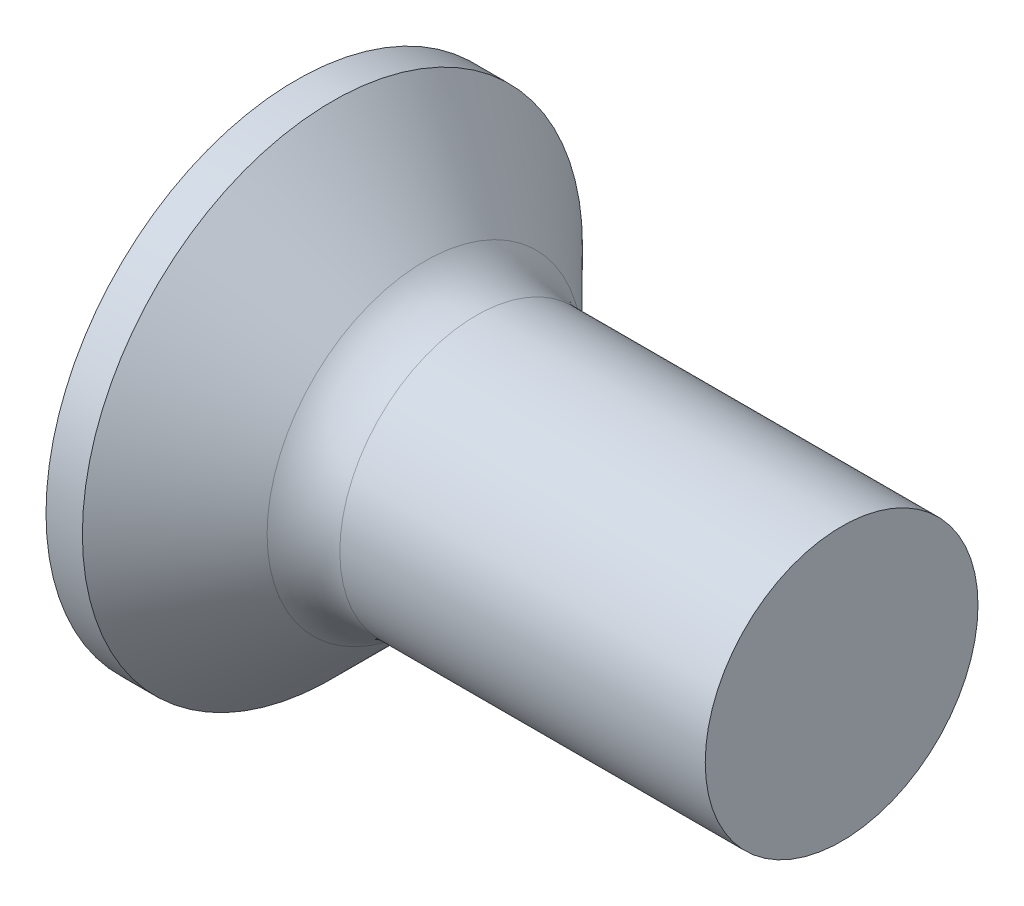
ISO-10303-21;
HEADER;
FILE_DESCRIPTION(('STEP AP214'),'2;1');
FILE_NAME('part.step','',(''),(''),'','','');
FILE_SCHEMA(('AUTOMOTIVE_DESIGN { 1 0 10303 214 1 1 1 1 }'));
ENDSEC;
DATA;
#1=APPLICATION_CONTEXT('core data for automotive mechanical design processes');
#2=APPLICATION_PROTOCOL_DEFINITION('international standard','automotive_design',2000,#1);
#3=PRODUCT_CONTEXT('',#1,'mechanical');
#4=PRODUCT('Part','Part','',(#3));
#5=PRODUCT_RELATED_PRODUCT_CATEGORY('part','',(#4));
#6=PRODUCT_DEFINITION_FORMATION('','',#4);
#7=PRODUCT_DEFINITION_CONTEXT('part definition',#1,'design');
#8=PRODUCT_DEFINITION('design','',#6,#7);
#9=PRODUCT_DEFINITION_SHAPE('','',#8);
#10=(LENGTH_UNIT() NAMED_UNIT(*) SI_UNIT(.MILLI.,.METRE.));
#11=(NAMED_UNIT(*) PLANE_ANGLE_UNIT() SI_UNIT($,.RADIAN.));
#12=(NAMED_UNIT(*) SI_UNIT($,.STERADIAN.) SOLID_ANGLE_UNIT());
#13=UNCERTAINTY_MEASURE_WITH_UNIT(LENGTH_MEASURE(1.E-05),#10,'distance_accuracy_value','');
#14=(GEOMETRIC_REPRESENTATION_CONTEXT(3) GLOBAL_UNCERTAINTY_ASSIGNED_CONTEXT((#13)) GLOBAL_UNIT_ASSIGNED_CONTEXT((#10,
#11,#12)) REPRESENTATION_CONTEXT('',''));
#15=CARTESIAN_POINT('',(0.,0.,0.));
#16=DIRECTION('',(0.,0.,1.));
#17=DIRECTION('',(1.,0.,0.));
#18=AXIS2_PLACEMENT_3D('',#15,#16,#17);
#19=CARTESIAN_POINT('',(0.,0.,0.));
#20=DIRECTION('',(-1.,0.,0.));
#21=DIRECTION('',(0.,0.,1.));
#22=AXIS2_PLACEMENT_3D('',#19,#20,#21);
#23=PLANE('',#22);
#24=CARTESIAN_POINT('',(0.,0.,0.));
#25=DIRECTION('',(-1.,0.,0.));
#26=DIRECTION('',(0.,0.,1.));
#27=AXIS2_PLACEMENT_3D('',#24,#25,#26);
#28=CIRCLE('',#27,2.75);
#29=CARTESIAN_POINT('',(0.,0.,2.75));
#30=VERTEX_POINT('',#29);
#31=EDGE_CURVE('E234',#30,#30,#28,.T.);
#32=ORIENTED_EDGE('',*,*,#31,.T.);
#33=EDGE_LOOP('',(#32));
#34=FACE_BOUND('',#33,.T.);
#35=DIRECTION('',(0.,0.,-1.));
#36=VECTOR('',#35,1.);
#37=CARTESIAN_POINT('',(0.,-0.370000000000005,1.5));
#38=LINE('',#37,#36);
#39=CARTESIAN_POINT('',(0.,-0.370000000000005,1.5));
#40=VERTEX_POINT('',#39);
#41=CARTESIAN_POINT('',(0.,-0.370000000000002,0.590157547916261));
#42=VERTEX_POINT('',#41);
#43=EDGE_CURVE('E324',#40,#42,#38,.T.);
#44=ORIENTED_EDGE('',*,*,#43,.T.);
#45=CARTESIAN_POINT('',(0.,0.,0.));
#46=DIRECTION('',(-1.,0.,0.));
#47=DIRECTION('',(0.,0.,1.));
#48=AXIS2_PLACEMENT_3D('',#45,#46,#47);
#49=CIRCLE('',#48,0.69655289200644);
#50=CARTESIAN_POINT('',(0.,-0.590157547916262,0.37));
#51=VERTEX_POINT('',#50);
#52=EDGE_CURVE('E429',#51,#42,#49,.T.);
#53=ORIENTED_EDGE('',*,*,#52,.F.);
#54=DIRECTION('',(0.,-1.,0.));
#55=VECTOR('',#54,1.);
#56=CARTESIAN_POINT('',(0.,1.5,0.37));
#57=LINE('',#56,#55);
#58=CARTESIAN_POINT('',(0.,-1.5,0.37));
#59=VERTEX_POINT('',#58);
#60=EDGE_CURVE('E285',#51,#59,#57,.T.);
#61=ORIENTED_EDGE('',*,*,#60,.T.);
#62=DIRECTION('',(0.,0.,-1.));
#63=VECTOR('',#62,1.);
#64=CARTESIAN_POINT('',(0.,-1.5,0.37));
#65=LINE('',#64,#63);
#66=CARTESIAN_POINT('',(0.,-1.5,-0.369999999999999));
#67=VERTEX_POINT('',#66);
#68=EDGE_CURVE('E247',#59,#67,#65,.T.);
#69=ORIENTED_EDGE('',*,*,#68,.T.);
#70=DIRECTION('',(0.,1.,0.));
#71=VECTOR('',#70,1.);
#72=CARTESIAN_POINT('',(0.,-1.5,-0.369999999999999));
#73=LINE('',#72,#71);
#74=CARTESIAN_POINT('',(0.,-0.590157547916262,-0.37));
#75=VERTEX_POINT('',#74);
#76=EDGE_CURVE('E279',#67,#75,#73,.T.);
#77=ORIENTED_EDGE('',*,*,#76,.T.);
#78=CARTESIAN_POINT('',(0.,-0.369999999999998,-0.590157547916264));
#79=VERTEX_POINT('',#78);
#80=EDGE_CURVE('E438',#79,#75,#49,.T.);
#81=ORIENTED_EDGE('',*,*,#80,.F.);
#82=CARTESIAN_POINT('',(0.,-0.369999999999995,-1.5));
#83=VERTEX_POINT('',#82);
#84=EDGE_CURVE('E327',#79,#83,#38,.T.);
#85=ORIENTED_EDGE('',*,*,#84,.T.);
#86=DIRECTION('',(0.,1.,0.));
#87=VECTOR('',#86,1.);
#88=CARTESIAN_POINT('',(0.,-0.369999999999995,-1.5));
#89=LINE('',#88,#87);
#90=CARTESIAN_POINT('',(0.,0.370000000000004,-1.5));
#91=VERTEX_POINT('',#90);
#92=EDGE_CURVE('E321',#83,#91,#89,.T.);
#93=ORIENTED_EDGE('',*,*,#92,.T.);
#94=DIRECTION('',(0.,0.,1.));
#95=VECTOR('',#94,1.);
#96=CARTESIAN_POINT('',(0.,0.370000000000004,-1.5));
#97=LINE('',#96,#95);
#98=CARTESIAN_POINT('',(0.,0.370000000000002,-0.590157547916261));
#99=VERTEX_POINT('',#98);
#100=EDGE_CURVE('E317',#91,#99,#97,.T.);
#101=ORIENTED_EDGE('',*,*,#100,.T.);
#102=CARTESIAN_POINT('',(0.,0.590157547916263,-0.369999999999999));
#103=VERTEX_POINT('',#102);
#104=EDGE_CURVE('E433',#103,#99,#49,.T.);
#105=ORIENTED_EDGE('',*,*,#104,.F.);
#106=CARTESIAN_POINT('',(0.,1.5,-0.369999999999999));
#107=VERTEX_POINT('',#106);
#108=EDGE_CURVE('E278',#103,#107,#73,.T.);
#109=ORIENTED_EDGE('',*,*,#108,.T.);
#110=DIRECTION('',(0.,0.,1.));
#111=VECTOR('',#110,1.);
#112=CARTESIAN_POINT('',(0.,1.5,-0.369999999999999));
#113=LINE('',#112,#111);
#114=CARTESIAN_POINT('',(0.,1.5,0.37));
#115=VERTEX_POINT('',#114);
#116=EDGE_CURVE('E281',#107,#115,#113,.T.);
#117=ORIENTED_EDGE('',*,*,#116,.T.);
#118=CARTESIAN_POINT('',(0.,0.590157547916263,0.37));
#119=VERTEX_POINT('',#118);
#120=EDGE_CURVE('E249',#115,#119,#57,.T.);
#121=ORIENTED_EDGE('',*,*,#120,.T.);
#122=CARTESIAN_POINT('',(0.,0.369999999999997,0.590157547916264));
#123=VERTEX_POINT('',#122);
#124=EDGE_CURVE('E432',#123,#119,#49,.T.);
#125=ORIENTED_EDGE('',*,*,#124,.F.);
#126=CARTESIAN_POINT('',(0.,0.369999999999994,1.5));
#127=VERTEX_POINT('',#126);
#128=EDGE_CURVE('E316',#123,#127,#97,.T.);
#129=ORIENTED_EDGE('',*,*,#128,.T.);
#130=DIRECTION('',(0.,-1.,0.));
#131=VECTOR('',#130,1.);
#132=CARTESIAN_POINT('',(0.,0.369999999999994,1.5));
#133=LINE('',#132,#131);
#134=EDGE_CURVE('E320',#127,#40,#133,.T.);
#135=ORIENTED_EDGE('',*,*,#134,.T.);
#136=EDGE_LOOP('',(#44,#53,#61,#69,#77,#81,#85,#93,#101,#105,#109,#117,#121,#125,#129,#135));
#137=FACE_BOUND('',#136,.T.);
#138=ADVANCED_FACE('F34',(#34,#137),#23,.T.);
#139=CARTESIAN_POINT('',(2.01,-0.497851002391851,0.370000000000001));
#140=DIRECTION('',(0.,0.,-1.));
#141=DIRECTION('',(-1.,0.,0.));
#142=AXIS2_PLACEMENT_3D('',#139,#140,#141);
#143=PLANE('',#142);
#144=ORIENTED_EDGE('',*,*,#60,.F.);
#145=CARTESIAN_POINT('',(-1.01053649699026,-0.672102030078459,0.37));
#146=CARTESIAN_POINT('',(-0.799706058781646,-0.65526709888962,0.37));
#147=CARTESIAN_POINT('',(-0.588886212565098,-0.638297110577309,0.37));
#148=CARTESIAN_POINT('',(-0.167272662573758,-0.603984130523452,0.37));
#149=CARTESIAN_POINT('',(0.0435210405937219,-0.586641131327184,0.37));
#150=CARTESIAN_POINT('',(0.465068838236452,-0.551479911668093,0.37));
#151=CARTESIAN_POINT('',(0.675822932725247,-0.533661691368077,0.37));
#152=CARTESIAN_POINT('',(1.09727362087867,-0.497387538868942,0.37));
#153=CARTESIAN_POINT('',(1.30797021528206,-0.478931615293403,0.37));
#154=CARTESIAN_POINT('',(1.67418894765493,-0.446067164114375,0.37));
#155=CARTESIAN_POINT('',(1.82972932594024,-0.431862501020784,0.37));
#156=CARTESIAN_POINT('',(2.14074770367772,-0.402797709732014,0.370000000000001));
#157=CARTESIAN_POINT('',(2.29622570364502,-0.387937587067169,0.370000000000001));
#158=CARTESIAN_POINT('',(2.60710169356699,-0.357305117929345,0.370000000000001));
#159=CARTESIAN_POINT('',(2.76249967848536,-0.341532719782114,0.370000000000001));
#160=CARTESIAN_POINT('',(2.99549070750468,-0.316847908272696,0.370000000000001));
#161=CARTESIAN_POINT('',(3.07313791127142,-0.308448465888146,0.370000000000001));
#162=CARTESIAN_POINT('',(3.22838341584044,-0.291202251038987,0.370000000000001));
#163=CARTESIAN_POINT('',(3.30598171607669,-0.282355473489552,0.370000000000001));
#164=CARTESIAN_POINT('',(3.38354828471668,-0.273232461280213,0.370000000000001));
#165=B_SPLINE_CURVE_WITH_KNOTS('',3,(#145,#146,#147,#148,#149,#150,#151,#152,#153,#154,#155,
#156,#157,#158,#159,#160,#161,#162,#163,#164),.UNSPECIFIED.,.F.,.F.,(4,2,2,2,2,2,2,2,2,4),(0.,
0.634504777580944,1.26902224771403,1.90353950046914,2.53804817608336,3.00661008454961,
3.47516804035678,3.94375256285268,4.17805198347564,4.41235406796206),.UNSPECIFIED.);
#166=CARTESIAN_POINT('',(2.01,-0.415013252800436,0.370000000000001));
#167=VERTEX_POINT('',#166);
#168=EDGE_CURVE('E330',#51,#167,#165,.T.);
#169=ORIENTED_EDGE('',*,*,#168,.T.);
#170=DIRECTION('',(0.,-1.,0.));
#171=VECTOR('',#170,1.);
#172=CARTESIAN_POINT('',(2.01,0.497851002391851,0.37));
#173=LINE('',#172,#171);
#174=CARTESIAN_POINT('',(2.01,-0.497851002391851,0.370000000000001));
#175=VERTEX_POINT('',#174);
#176=EDGE_CURVE('E265',#167,#175,#173,.T.);
#177=ORIENTED_EDGE('',*,*,#176,.T.);
#178=DIRECTION('',(0.894934367749961,0.446197800778958,0.));
#179=VECTOR('',#178,1.);
#180=CARTESIAN_POINT('',(0.,-1.5,0.37));
#181=LINE('',#180,#179);
#182=EDGE_CURVE('E275',#59,#175,#181,.T.);
#183=ORIENTED_EDGE('',*,*,#182,.F.);
#184=EDGE_LOOP('',(#144,#169,#177,#183));
#185=FACE_BOUND('',#184,.T.);
#186=ADVANCED_FACE('F188',(#185),#143,.T.);
#187=CARTESIAN_POINT('',(2.01,0.497851002391851,0.37));
#188=VERTEX_POINT('',#187);
#189=CARTESIAN_POINT('',(2.01,0.415013252800436,0.37));
#190=VERTEX_POINT('',#189);
#191=EDGE_CURVE('E262',#188,#190,#173,.T.);
#192=ORIENTED_EDGE('',*,*,#191,.T.);
#193=CARTESIAN_POINT('',(-1.01053649691082,0.672102030072117,0.369999999999999));
#194=CARTESIAN_POINT('',(-0.799706058711029,0.655267098883947,0.369999999999999));
#195=CARTESIAN_POINT('',(-0.588886212503304,0.638297110572311,0.369999999999999));
#196=CARTESIAN_POINT('',(-0.16727266252961,0.603984130519827,0.37));
#197=CARTESIAN_POINT('',(0.0435210406290474,0.586641131324258,0.37));
#198=CARTESIAN_POINT('',(0.465068838244709,0.551479911667384,0.37));
#199=CARTESIAN_POINT('',(0.67582293271526,0.533661691368909,0.37));
#200=CARTESIAN_POINT('',(1.09727362083221,0.49738753887297,0.37));
#201=CARTESIAN_POINT('',(1.30797021521736,0.478931615299088,0.37));
#202=CARTESIAN_POINT('',(1.67418894757201,0.446067164121905,0.37));
#203=CARTESIAN_POINT('',(1.82972932585734,0.431862501028413,0.37));
#204=CARTESIAN_POINT('',(2.14074770359484,0.402797709739879,0.37));
#205=CARTESIAN_POINT('',(2.29622570356215,0.387937587075169,0.37));
#206=CARTESIAN_POINT('',(2.60710169348415,0.357305117937675,0.370000000000001));
#207=CARTESIAN_POINT('',(2.76249967840253,0.341532719790639,0.370000000000001));
#208=CARTESIAN_POINT('',(2.99549070742189,0.316847908281593,0.370000000000001));
#209=CARTESIAN_POINT('',(3.07313791118864,0.308448465897181,0.370000000000001));
#210=CARTESIAN_POINT('',(3.22838341575769,0.291202251048337,0.370000000000001));
#211=CARTESIAN_POINT('',(3.30598171599396,0.28235547349908,0.370000000000001));
#212=CARTESIAN_POINT('',(3.38354828463398,0.273232461289949,0.370000000000001));
#213=B_SPLINE_CURVE_WITH_KNOTS('',3,(#193,#194,#195,#196,#197,#198,#199,#200,#201,#202,#203,
#204,#205,#206,#207,#208,#209,#210,#211,#212),.UNSPECIFIED.,.F.,.F.,(4,2,2,2,2,2,2,2,2,4),(0.,
0.634504777554396,1.26902224766093,1.90353950036111,2.53804817592041,3.00661008438666,
3.47516804019383,3.94375256268972,4.17805198331267,4.41235406779909),.UNSPECIFIED.);
#214=EDGE_CURVE('E336',#190,#119,#213,.F.);
#215=ORIENTED_EDGE('',*,*,#214,.T.);
#216=ORIENTED_EDGE('',*,*,#120,.F.);
#217=DIRECTION('',(0.89493436774996,-0.446197800778958,0.));
#218=VECTOR('',#217,1.);
#219=CARTESIAN_POINT('',(0.,1.5,0.37));
#220=LINE('',#219,#218);
#221=EDGE_CURVE('E57',#115,#188,#220,.T.);
#222=ORIENTED_EDGE('',*,*,#221,.T.);
#223=EDGE_LOOP('',(#192,#215,#216,#222));
#224=FACE_BOUND('',#223,.T.);
#225=ADVANCED_FACE('F194',(#224),#143,.T.);
#226=CARTESIAN_POINT('',(2.01,0.497851002391851,-0.37));
#227=DIRECTION('',(0.,0.,1.));
#228=DIRECTION('',(0.,-1.,0.));
#229=AXIS2_PLACEMENT_3D('',#226,#227,#228);
#230=PLANE('',#229);
#231=DIRECTION('',(0.,1.,0.));
#232=VECTOR('',#231,1.);
#233=CARTESIAN_POINT('',(2.01,-0.497851002391851,-0.37));
#234=LINE('',#233,#232);
#235=CARTESIAN_POINT('',(2.01,-0.497851002391851,-0.37));
#236=VERTEX_POINT('',#235);
#237=CARTESIAN_POINT('',(2.01,-0.415013252800436,-0.37));
#238=VERTEX_POINT('',#237);
#239=EDGE_CURVE('E252',#236,#238,#234,.T.);
#240=ORIENTED_EDGE('',*,*,#239,.T.);
#241=CARTESIAN_POINT('',(-1.01053649691082,-0.672102030072117,-0.369999999999999));
#242=CARTESIAN_POINT('',(-0.799706058711029,-0.655267098883947,-0.37));
#243=CARTESIAN_POINT('',(-0.588886212503303,-0.638297110572311,-0.37));
#244=CARTESIAN_POINT('',(-0.16727266252961,-0.603984130519827,-0.37));
#245=CARTESIAN_POINT('',(0.0435210406290474,-0.586641131324258,-0.37));
#246=CARTESIAN_POINT('',(0.465068838244709,-0.551479911667384,-0.37));
#247=CARTESIAN_POINT('',(0.67582293271526,-0.533661691368909,-0.37));
#248=CARTESIAN_POINT('',(1.09727362083221,-0.49738753887297,-0.37));
#249=CARTESIAN_POINT('',(1.30797021521736,-0.478931615299089,-0.37));
#250=CARTESIAN_POINT('',(1.67418894757201,-0.446067164121905,-0.37));
#251=CARTESIAN_POINT('',(1.82972932585734,-0.431862501028414,-0.37));
#252=CARTESIAN_POINT('',(2.14074770359484,-0.402797709739879,-0.37));
#253=CARTESIAN_POINT('',(2.29622570356215,-0.387937587075169,-0.37));
#254=CARTESIAN_POINT('',(2.60710169348415,-0.357305117937676,-0.37));
#255=CARTESIAN_POINT('',(2.76249967840253,-0.341532719790639,-0.37));
#256=CARTESIAN_POINT('',(2.99549070742189,-0.316847908281594,-0.37));
#257=CARTESIAN_POINT('',(3.07313791118864,-0.308448465897181,-0.37));
#258=CARTESIAN_POINT('',(3.22838341575769,-0.291202251048338,-0.37));
#259=CARTESIAN_POINT('',(3.30598171599396,-0.282355473499081,-0.37));
#260=CARTESIAN_POINT('',(3.38354828463398,-0.273232461289949,-0.37));
#261=B_SPLINE_CURVE_WITH_KNOTS('',3,(#241,#242,#243,#244,#245,#246,#247,#248,#249,#250,#251,
#252,#253,#254,#255,#256,#257,#258,#259,#260),.UNSPECIFIED.,.F.,.F.,(4,2,2,2,2,2,2,2,2,4),(0.,
0.634504777554396,1.26902224766093,1.90353950036111,2.53804817592041,3.00661008438666,
3.47516804019383,3.94375256268972,4.17805198331267,4.41235406779909),.UNSPECIFIED.);
#262=EDGE_CURVE('E385',#238,#75,#261,.F.);
#263=ORIENTED_EDGE('',*,*,#262,.T.);
#264=ORIENTED_EDGE('',*,*,#76,.F.);
#265=DIRECTION('',(0.89493436774996,0.446197800778958,0.));
#266=VECTOR('',#265,1.);
#267=CARTESIAN_POINT('',(0.,-1.5,-0.369999999999999));
#268=LINE('',#267,#266);
#269=EDGE_CURVE('E272',#67,#236,#268,.T.);
#270=ORIENTED_EDGE('',*,*,#269,.T.);
#271=EDGE_LOOP('',(#240,#263,#264,#270));
#272=FACE_BOUND('',#271,.T.);
#273=ADVANCED_FACE('F390',(#272),#230,.T.);
#274=ORIENTED_EDGE('',*,*,#108,.F.);
#275=CARTESIAN_POINT('',(-1.01053649699026,0.672102030078459,-0.369999999999999));
#276=CARTESIAN_POINT('',(-0.799706058781647,0.65526709888962,-0.369999999999999));
#277=CARTESIAN_POINT('',(-0.588886212565098,0.638297110577309,-0.369999999999999));
#278=CARTESIAN_POINT('',(-0.167272662573758,0.603984130523452,-0.369999999999999));
#279=CARTESIAN_POINT('',(0.0435210405937223,0.586641131327184,-0.369999999999999));
#280=CARTESIAN_POINT('',(0.465068838236453,0.551479911668094,-0.37));
#281=CARTESIAN_POINT('',(0.675822932725247,0.533661691368078,-0.37));
#282=CARTESIAN_POINT('',(1.09727362087867,0.497387538868942,-0.37));
#283=CARTESIAN_POINT('',(1.30797021528206,0.478931615293403,-0.37));
#284=CARTESIAN_POINT('',(1.67418894765493,0.446067164114375,-0.37));
#285=CARTESIAN_POINT('',(1.82972932594024,0.431862501020785,-0.37));
#286=CARTESIAN_POINT('',(2.14074770367772,0.402797709732015,-0.37));
#287=CARTESIAN_POINT('',(2.29622570364502,0.387937587067169,-0.37));
#288=CARTESIAN_POINT('',(2.60710169356699,0.357305117929345,-0.37));
#289=CARTESIAN_POINT('',(2.76249967848536,0.341532719782115,-0.37));
#290=CARTESIAN_POINT('',(2.99549070750468,0.316847908272697,-0.37));
#291=CARTESIAN_POINT('',(3.07313791127142,0.308448465888147,-0.37));
#292=CARTESIAN_POINT('',(3.22838341584044,0.291202251038988,-0.37));
#293=CARTESIAN_POINT('',(3.30598171607669,0.282355473489552,-0.37));
#294=CARTESIAN_POINT('',(3.38354828471668,0.273232461280214,-0.37));
#295=B_SPLINE_CURVE_WITH_KNOTS('',3,(#275,#276,#277,#278,#279,#280,#281,#282,#283,#284,#285,
#286,#287,#288,#289,#290,#291,#292,#293,#294),.UNSPECIFIED.,.F.,.F.,(4,2,2,2,2,2,2,2,2,4),(0.,
0.634504777580944,1.26902224771403,1.90353950046914,2.53804817608336,3.00661008454961,
3.47516804035678,3.94375256285268,4.17805198347564,4.41235406796206),.UNSPECIFIED.);
#296=CARTESIAN_POINT('',(2.01,0.415013252800436,-0.37));
#297=VERTEX_POINT('',#296);
#298=EDGE_CURVE('E380',#103,#297,#295,.T.);
#299=ORIENTED_EDGE('',*,*,#298,.T.);
#300=CARTESIAN_POINT('',(2.01,0.497851002391851,-0.37));
#301=VERTEX_POINT('',#300);
#302=EDGE_CURVE('E256',#297,#301,#234,.T.);
#303=ORIENTED_EDGE('',*,*,#302,.T.);
#304=DIRECTION('',(0.89493436774996,-0.446197800778958,0.));
#305=VECTOR('',#304,1.);
#306=CARTESIAN_POINT('',(0.,1.5,-0.369999999999999));
#307=LINE('',#306,#305);
#308=EDGE_CURVE('E260',#107,#301,#307,.T.);
#309=ORIENTED_EDGE('',*,*,#308,.F.);
#310=EDGE_LOOP('',(#274,#299,#303,#309));
#311=FACE_BOUND('',#310,.T.);
#312=ADVANCED_FACE('F393',(#311),#230,.T.);
#313=CARTESIAN_POINT('',(2.01,-0.497851002391851,-0.37));
#314=DIRECTION('',(-1.,0.,0.));
#315=DIRECTION('',(0.,0.,1.));
#316=AXIS2_PLACEMENT_3D('',#313,#314,#315);
#317=PLANE('',#316);
#318=DIRECTION('',(0.,-1.,0.));
#319=VECTOR('',#318,1.);
#320=CARTESIAN_POINT('',(2.01,0.369999999999998,0.497851002391852));
#321=LINE('',#320,#319);
#322=CARTESIAN_POINT('',(2.01,-0.247548741498374,0.49785100239185));
#323=VERTEX_POINT('',#322);
#324=CARTESIAN_POINT('',(2.01,-0.370000000000002,0.49785100239185));
#325=VERTEX_POINT('',#324);
#326=EDGE_CURVE('E291',#323,#325,#321,.T.);
#327=ORIENTED_EDGE('',*,*,#326,.F.);
#328=CARTESIAN_POINT('',(2.01,0.,0.));
#329=DIRECTION('',(-1.,0.,0.));
#330=DIRECTION('',(0.,0.,1.));
#331=AXIS2_PLACEMENT_3D('',#328,#329,#330);
#332=CIRCLE('',#331,0.555999999999999);
#333=CARTESIAN_POINT('',(2.01,-0.370000000000002,0.415013252800434));
#334=VERTEX_POINT('',#333);
#335=EDGE_CURVE('E49',#334,#323,#332,.T.);
#336=ORIENTED_EDGE('',*,*,#335,.F.);
#337=DIRECTION('',(0.,0.,-1.));
#338=VECTOR('',#337,1.);
#339=CARTESIAN_POINT('',(2.01,-0.370000000000002,0.497851002391849));
#340=LINE('',#339,#338);
#341=EDGE_CURVE('E298',#325,#334,#340,.T.);
#342=ORIENTED_EDGE('',*,*,#341,.F.);
#343=EDGE_LOOP('',(#327,#336,#342));
#344=FACE_BOUND('',#343,.T.);
#345=ADVANCED_FACE('F201',(#344),#317,.T.);
#346=ORIENTED_EDGE('',*,*,#176,.F.);
#347=CARTESIAN_POINT('',(2.01,-0.49785100239185,0.247548741498373));
#348=VERTEX_POINT('',#347);
#349=EDGE_CURVE('E459',#348,#167,#332,.T.);
#350=ORIENTED_EDGE('',*,*,#349,.F.);
#351=DIRECTION('',(0.,0.,-1.));
#352=VECTOR('',#351,1.);
#353=CARTESIAN_POINT('',(2.01,-0.497851002391851,0.370000000000001));
#354=LINE('',#353,#352);
#355=EDGE_CURVE('E257',#175,#348,#354,.T.);
#356=ORIENTED_EDGE('',*,*,#355,.F.);
#357=EDGE_LOOP('',(#346,#350,#356));
#358=FACE_BOUND('',#357,.T.);
#359=ADVANCED_FACE('F457',(#358),#317,.T.);
#360=CARTESIAN_POINT('',(2.01,-0.49785100239185,-0.247548741498373));
#361=VERTEX_POINT('',#360);
#362=EDGE_CURVE('E261',#361,#236,#354,.T.);
#363=ORIENTED_EDGE('',*,*,#362,.F.);
#364=EDGE_CURVE('E469',#238,#361,#332,.T.);
#365=ORIENTED_EDGE('',*,*,#364,.F.);
#366=ORIENTED_EDGE('',*,*,#239,.F.);
#367=EDGE_LOOP('',(#363,#365,#366));
#368=FACE_BOUND('',#367,.T.);
#369=ADVANCED_FACE('F467',(#368),#317,.T.);
#370=CARTESIAN_POINT('',(2.01,-0.369999999999999,-0.415013252800437));
#371=VERTEX_POINT('',#370);
#372=CARTESIAN_POINT('',(2.01,-0.369999999999999,-0.497851002391852));
#373=VERTEX_POINT('',#372);
#374=EDGE_CURVE('E301',#371,#373,#340,.T.);
#375=ORIENTED_EDGE('',*,*,#374,.F.);
#376=CARTESIAN_POINT('',(2.01,-0.247548741498372,-0.497851002391851));
#377=VERTEX_POINT('',#376);
#378=EDGE_CURVE('E472',#377,#371,#332,.T.);
#379=ORIENTED_EDGE('',*,*,#378,.F.);
#380=DIRECTION('',(0.,1.,0.));
#381=VECTOR('',#380,1.);
#382=CARTESIAN_POINT('',(2.01,-0.369999999999999,-0.497851002391852));
#383=LINE('',#382,#381);
#384=EDGE_CURVE('E293',#373,#377,#383,.T.);
#385=ORIENTED_EDGE('',*,*,#384,.F.);
#386=EDGE_LOOP('',(#375,#379,#385));
#387=FACE_BOUND('',#386,.T.);
#388=ADVANCED_FACE('F501',(#387),#317,.T.);
#389=CARTESIAN_POINT('',(2.01,0.247548741498374,-0.49785100239185));
#390=VERTEX_POINT('',#389);
#391=CARTESIAN_POINT('',(2.01,0.370000000000002,-0.497851002391849));
#392=VERTEX_POINT('',#391);
#393=EDGE_CURVE('E297',#390,#392,#383,.T.);
#394=ORIENTED_EDGE('',*,*,#393,.F.);
#395=CARTESIAN_POINT('',(2.01,0.370000000000002,-0.415013252800435));
#396=VERTEX_POINT('',#395);
#397=EDGE_CURVE('E427',#396,#390,#332,.T.);
#398=ORIENTED_EDGE('',*,*,#397,.F.);
#399=DIRECTION('',(0.,0.,1.));
#400=VECTOR('',#399,1.);
#401=CARTESIAN_POINT('',(2.01,0.370000000000002,-0.497851002391849));
#402=LINE('',#401,#400);
#403=EDGE_CURVE('E288',#392,#396,#402,.T.);
#404=ORIENTED_EDGE('',*,*,#403,.F.);
#405=EDGE_LOOP('',(#394,#398,#404));
#406=FACE_BOUND('',#405,.T.);
#407=ADVANCED_FACE('F497',(#406),#317,.T.);
#408=ORIENTED_EDGE('',*,*,#302,.F.);
#409=CARTESIAN_POINT('',(2.01,0.497851002391851,-0.247548741498373));
#410=VERTEX_POINT('',#409);
#411=EDGE_CURVE('E419',#410,#297,#332,.T.);
#412=ORIENTED_EDGE('',*,*,#411,.F.);
#413=DIRECTION('',(0.,0.,1.));
#414=VECTOR('',#413,1.);
#415=CARTESIAN_POINT('',(2.01,0.497851002391851,-0.37));
#416=LINE('',#415,#414);
#417=EDGE_CURVE('E266',#301,#410,#416,.T.);
#418=ORIENTED_EDGE('',*,*,#417,.F.);
#419=EDGE_LOOP('',(#408,#412,#418));
#420=FACE_BOUND('',#419,.T.);
#421=ADVANCED_FACE('F417',(#420),#317,.T.);
#422=CARTESIAN_POINT('',(2.01,0.497851002391851,0.247548741498373));
#423=VERTEX_POINT('',#422);
#424=EDGE_CURVE('E255',#423,#188,#416,.T.);
#425=ORIENTED_EDGE('',*,*,#424,.F.);
#426=EDGE_CURVE('E426',#190,#423,#332,.T.);
#427=ORIENTED_EDGE('',*,*,#426,.F.);
#428=ORIENTED_EDGE('',*,*,#191,.F.);
#429=EDGE_LOOP('',(#425,#427,#428));
#430=FACE_BOUND('',#429,.T.);
#431=ADVANCED_FACE('F491',(#430),#317,.T.);
#432=CARTESIAN_POINT('',(2.01,0.369999999999999,0.415013252800437));
#433=VERTEX_POINT('',#432);
#434=CARTESIAN_POINT('',(2.01,0.369999999999998,0.497851002391852));
#435=VERTEX_POINT('',#434);
#436=EDGE_CURVE('E292',#433,#435,#402,.T.);
#437=ORIENTED_EDGE('',*,*,#436,.F.);
#438=CARTESIAN_POINT('',(2.01,0.247548741498371,0.497851002391852));
#439=VERTEX_POINT('',#438);
#440=EDGE_CURVE('E428',#439,#433,#332,.T.);
#441=ORIENTED_EDGE('',*,*,#440,.F.);
#442=EDGE_CURVE('E302',#435,#439,#321,.T.);
#443=ORIENTED_EDGE('',*,*,#442,.F.);
#444=EDGE_LOOP('',(#437,#441,#443));
#445=FACE_BOUND('',#444,.T.);
#446=ADVANCED_FACE('F407',(#445),#317,.T.);
#447=CARTESIAN_POINT('',(0.,-1.5,-0.369999999999999));
#448=DIRECTION('',(-0.446197800778958,0.89493436774996,0.));
#449=DIRECTION('',(-0.89493436774996,-0.446197800778958,0.));
#450=AXIS2_PLACEMENT_3D('',#447,#448,#449);
#451=PLANE('',#450);
#452=ORIENTED_EDGE('',*,*,#355,.T.);
#453=CARTESIAN_POINT('',(2.86902882959523,-0.0695550419463993,0.));
#454=DIRECTION('',(-0.446197800778958,0.89493436774996,0.));
#455=DIRECTION('',(-0.89493436774996,-0.446197800778958,0.));
#456=AXIS2_PLACEMENT_3D('',#453,#454,#455);
#457=ELLIPSE('',#456,1.11145965245249,0.491029028347017);
#458=EDGE_CURVE('E461',#348,#361,#457,.F.);
#459=ORIENTED_EDGE('',*,*,#458,.T.);
#460=ORIENTED_EDGE('',*,*,#362,.T.);
#461=ORIENTED_EDGE('',*,*,#269,.F.);
#462=ORIENTED_EDGE('',*,*,#68,.F.);
#463=ORIENTED_EDGE('',*,*,#182,.T.);
#464=EDGE_LOOP('',(#452,#459,#460,#461,#462,#463));
#465=FACE_BOUND('',#464,.T.);
#466=ADVANCED_FACE('F399',(#465),#451,.T.);
#467=CARTESIAN_POINT('',(2.01,0.497851002391851,0.37));
#468=DIRECTION('',(-0.446197800778958,-0.89493436774996,0.));
#469=DIRECTION('',(0.89493436774996,-0.446197800778958,0.));
#470=AXIS2_PLACEMENT_3D('',#467,#468,#469);
#471=PLANE('',#470);
#472=ORIENTED_EDGE('',*,*,#417,.T.);
#473=CARTESIAN_POINT('',(2.86902882959523,0.0695550419463989,0.));
#474=DIRECTION('',(-0.446197800778958,-0.89493436774996,0.));
#475=DIRECTION('',(-0.89493436774996,0.446197800778958,0.));
#476=AXIS2_PLACEMENT_3D('',#473,#474,#475);
#477=ELLIPSE('',#476,1.11145965245249,0.491029028347017);
#478=EDGE_CURVE('E411',#410,#423,#477,.F.);
#479=ORIENTED_EDGE('',*,*,#478,.T.);
#480=ORIENTED_EDGE('',*,*,#424,.T.);
#481=ORIENTED_EDGE('',*,*,#221,.F.);
#482=ORIENTED_EDGE('',*,*,#116,.F.);
#483=ORIENTED_EDGE('',*,*,#308,.T.);
#484=EDGE_LOOP('',(#472,#479,#480,#481,#482,#483));
#485=FACE_BOUND('',#484,.T.);
#486=ADVANCED_FACE('F395',(#485),#471,.T.);
#487=CARTESIAN_POINT('',(2.01,-0.369999999999999,-0.497851002391852));
#488=DIRECTION('',(0.,1.,0.));
#489=DIRECTION('',(-1.,0.,0.));
#490=AXIS2_PLACEMENT_3D('',#487,#488,#489);
#491=PLANE('',#490);
#492=ORIENTED_EDGE('',*,*,#84,.F.);
#493=CARTESIAN_POINT('',(-1.01053649691082,-0.369999999999997,-0.672102030072118));
#494=CARTESIAN_POINT('',(-0.799706058711029,-0.369999999999997,-0.655267098883948));
#495=CARTESIAN_POINT('',(-0.588886212503303,-0.369999999999997,-0.638297110572312));
#496=CARTESIAN_POINT('',(-0.16727266252961,-0.369999999999998,-0.603984130519829));
#497=CARTESIAN_POINT('',(0.0435210406290476,-0.369999999999998,-0.586641131324259));
#498=CARTESIAN_POINT('',(0.465068838244709,-0.369999999999998,-0.551479911667386));
#499=CARTESIAN_POINT('',(0.67582293271526,-0.369999999999998,-0.53366169136891));
#500=CARTESIAN_POINT('',(1.09727362083221,-0.369999999999998,-0.497387538872971));
#501=CARTESIAN_POINT('',(1.30797021521736,-0.369999999999999,-0.47893161529909));
#502=CARTESIAN_POINT('',(1.67418894757201,-0.369999999999999,-0.446067164121906));
#503=CARTESIAN_POINT('',(1.82972932585734,-0.369999999999999,-0.431862501028414));
#504=CARTESIAN_POINT('',(2.14074770359484,-0.369999999999999,-0.40279770973988));
#505=CARTESIAN_POINT('',(2.29622570356215,-0.369999999999999,-0.38793758707517));
#506=CARTESIAN_POINT('',(2.60710169348415,-0.369999999999999,-0.357305117937676));
#507=CARTESIAN_POINT('',(2.76249967840253,-0.37,-0.34153271979064));
#508=CARTESIAN_POINT('',(2.99549070742189,-0.37,-0.316847908281594));
#509=CARTESIAN_POINT('',(3.07313791118864,-0.37,-0.308448465897182));
#510=CARTESIAN_POINT('',(3.22838341575769,-0.37,-0.291202251048339));
#511=CARTESIAN_POINT('',(3.30598171599396,-0.37,-0.282355473499082));
#512=CARTESIAN_POINT('',(3.38354828463398,-0.37,-0.27323246128995));
#513=B_SPLINE_CURVE_WITH_KNOTS('',3,(#493,#494,#495,#496,#497,#498,#499,#500,#501,#502,#503,
#504,#505,#506,#507,#508,#509,#510,#511,#512),.UNSPECIFIED.,.F.,.F.,(4,2,2,2,2,2,2,2,2,4),(0.,
0.634504777554396,1.26902224766093,1.90353950036111,2.53804817592041,3.00661008438666,
3.47516804019383,3.94375256268972,4.17805198331267,4.41235406779909),.UNSPECIFIED.);
#514=EDGE_CURVE('E373',#79,#371,#513,.T.);
#515=ORIENTED_EDGE('',*,*,#514,.T.);
#516=ORIENTED_EDGE('',*,*,#374,.T.);
#517=DIRECTION('',(0.894934367749961,0.,0.446197800778958));
#518=VECTOR('',#517,1.);
#519=CARTESIAN_POINT('',(0.,-0.369999999999995,-1.5));
#520=LINE('',#519,#518);
#521=EDGE_CURVE('E313',#83,#373,#520,.T.);
#522=ORIENTED_EDGE('',*,*,#521,.F.);
#523=EDGE_LOOP('',(#492,#515,#516,#522));
#524=FACE_BOUND('',#523,.T.);
#525=ADVANCED_FACE('F398',(#524),#491,.T.);
#526=CARTESIAN_POINT('',(2.01,0.369999999999998,0.497851002391852));
#527=DIRECTION('',(0.,-1.,0.));
#528=DIRECTION('',(0.,0.,-1.));
#529=AXIS2_PLACEMENT_3D('',#526,#527,#528);
#530=PLANE('',#529);
#531=ORIENTED_EDGE('',*,*,#403,.T.);
#532=CARTESIAN_POINT('',(-1.01053649691082,0.370000000000002,-0.672102030072116));
#533=CARTESIAN_POINT('',(-0.799706058711029,0.370000000000002,-0.655267098883946));
#534=CARTESIAN_POINT('',(-0.588886212503304,0.370000000000002,-0.638297110572309));
#535=CARTESIAN_POINT('',(-0.16727266252961,0.370000000000002,-0.603984130519826));
#536=CARTESIAN_POINT('',(0.0435210406290474,0.370000000000002,-0.586641131324257));
#537=CARTESIAN_POINT('',(0.465068838244709,0.370000000000002,-0.551479911667383));
#538=CARTESIAN_POINT('',(0.67582293271526,0.370000000000002,-0.533661691368907));
#539=CARTESIAN_POINT('',(1.09727362083221,0.370000000000002,-0.497387538872969));
#540=CARTESIAN_POINT('',(1.30797021521736,0.370000000000002,-0.478931615299087));
#541=CARTESIAN_POINT('',(1.67418894757201,0.370000000000002,-0.446067164121903));
#542=CARTESIAN_POINT('',(1.82972932585734,0.370000000000002,-0.431862501028412));
#543=CARTESIAN_POINT('',(2.14074770359484,0.370000000000001,-0.402797709739878));
#544=CARTESIAN_POINT('',(2.29622570356215,0.370000000000001,-0.387937587075168));
#545=CARTESIAN_POINT('',(2.60710169348415,0.370000000000001,-0.357305117937674));
#546=CARTESIAN_POINT('',(2.76249967840253,0.370000000000001,-0.341532719790638));
#547=CARTESIAN_POINT('',(2.99549070742189,0.370000000000001,-0.316847908281592));
#548=CARTESIAN_POINT('',(3.07313791118864,0.370000000000001,-0.30844846589718));
#549=CARTESIAN_POINT('',(3.22838341575769,0.370000000000001,-0.291202251048337));
#550=CARTESIAN_POINT('',(3.30598171599396,0.370000000000001,-0.28235547349908));
#551=CARTESIAN_POINT('',(3.38354828463398,0.370000000000001,-0.273232461289948));
#552=B_SPLINE_CURVE_WITH_KNOTS('',3,(#532,#533,#534,#535,#536,#537,#538,#539,#540,#541,#542,
#543,#544,#545,#546,#547,#548,#549,#550,#551),.UNSPECIFIED.,.F.,.F.,(4,2,2,2,2,2,2,2,2,4),(0.,
0.634504777554396,1.26902224766093,1.90353950036111,2.53804817592041,3.00661008438666,
3.47516804019383,3.94375256268972,4.17805198331267,4.41235406779909),.UNSPECIFIED.);
#553=EDGE_CURVE('E367',#396,#99,#552,.F.);
#554=ORIENTED_EDGE('',*,*,#553,.T.);
#555=ORIENTED_EDGE('',*,*,#100,.F.);
#556=DIRECTION('',(0.89493436774996,0.,0.446197800778958));
#557=VECTOR('',#556,1.);
#558=CARTESIAN_POINT('',(0.,0.370000000000004,-1.5));
#559=LINE('',#558,#557);
#560=EDGE_CURVE('E310',#91,#392,#559,.T.);
#561=ORIENTED_EDGE('',*,*,#560,.T.);
#562=EDGE_LOOP('',(#531,#554,#555,#561));
#563=FACE_BOUND('',#562,.T.);
#564=ADVANCED_FACE('F404',(#563),#530,.T.);
#565=CARTESIAN_POINT('',(0.,0.370000000000004,-1.5));
#566=DIRECTION('',(-0.446197800778958,0.,0.89493436774996));
#567=DIRECTION('',(-0.89493436774996,0.,-0.446197800778958));
#568=AXIS2_PLACEMENT_3D('',#565,#566,#567);
#569=PLANE('',#568);
#570=ORIENTED_EDGE('',*,*,#384,.T.);
#571=CARTESIAN_POINT('',(2.86902882959523,0.,-0.0695550419463993));
#572=DIRECTION('',(-0.446197800778958,0.,0.89493436774996));
#573=DIRECTION('',(-0.89493436774996,0.,-0.446197800778958));
#574=AXIS2_PLACEMENT_3D('',#571,#572,#573);
#575=ELLIPSE('',#574,1.11145965245249,0.491029028347017);
#576=EDGE_CURVE('E515',#377,#390,#575,.F.);
#577=ORIENTED_EDGE('',*,*,#576,.T.);
#578=ORIENTED_EDGE('',*,*,#393,.T.);
#579=ORIENTED_EDGE('',*,*,#560,.F.);
#580=ORIENTED_EDGE('',*,*,#92,.F.);
#581=ORIENTED_EDGE('',*,*,#521,.T.);
#582=EDGE_LOOP('',(#570,#577,#578,#579,#580,#581));
#583=FACE_BOUND('',#582,.T.);
#584=ADVANCED_FACE('F346',(#583),#569,.T.);
#585=ORIENTED_EDGE('',*,*,#341,.T.);
#586=CARTESIAN_POINT('',(-1.01053649699026,-0.370000000000002,0.672102030078457));
#587=CARTESIAN_POINT('',(-0.799706058781647,-0.370000000000002,0.655267098889619));
#588=CARTESIAN_POINT('',(-0.588886212565098,-0.370000000000002,0.638297110577308));
#589=CARTESIAN_POINT('',(-0.167272662573758,-0.370000000000002,0.603984130523451));
#590=CARTESIAN_POINT('',(0.0435210405937219,-0.370000000000002,0.586641131327183));
#591=CARTESIAN_POINT('',(0.465068838236452,-0.370000000000002,0.551479911668092));
#592=CARTESIAN_POINT('',(0.675822932725247,-0.370000000000002,0.533661691368076));
#593=CARTESIAN_POINT('',(1.09727362087867,-0.370000000000002,0.497387538868941));
#594=CARTESIAN_POINT('',(1.30797021528206,-0.370000000000002,0.478931615293402));
#595=CARTESIAN_POINT('',(1.67418894765493,-0.370000000000002,0.446067164114374));
#596=CARTESIAN_POINT('',(1.82972932594024,-0.370000000000002,0.431862501020783));
#597=CARTESIAN_POINT('',(2.14074770367772,-0.370000000000002,0.402797709732013));
#598=CARTESIAN_POINT('',(2.29622570364502,-0.370000000000002,0.387937587067168));
#599=CARTESIAN_POINT('',(2.60710169356699,-0.370000000000002,0.357305117929344));
#600=CARTESIAN_POINT('',(2.76249967848536,-0.370000000000002,0.341532719782113));
#601=CARTESIAN_POINT('',(2.99549070750468,-0.370000000000002,0.316847908272695));
#602=CARTESIAN_POINT('',(3.07313791127142,-0.370000000000002,0.308448465888145));
#603=CARTESIAN_POINT('',(3.22838341584044,-0.370000000000002,0.291202251038986));
#604=CARTESIAN_POINT('',(3.30598171607669,-0.370000000000002,0.28235547348955));
#605=CARTESIAN_POINT('',(3.38354828471668,-0.370000000000002,0.273232461280212));
#606=B_SPLINE_CURVE_WITH_KNOTS('',3,(#586,#587,#588,#589,#590,#591,#592,#593,#594,#595,#596,
#597,#598,#599,#600,#601,#602,#603,#604,#605),.UNSPECIFIED.,.F.,.F.,(4,2,2,2,2,2,2,2,2,4),(0.,
0.634504777580944,1.26902224771403,1.90353950046914,2.53804817608336,3.00661008454961,
3.47516804035678,3.94375256285268,4.17805198347564,4.41235406796205),.UNSPECIFIED.);
#607=EDGE_CURVE('E360',#334,#42,#606,.F.);
#608=ORIENTED_EDGE('',*,*,#607,.T.);
#609=ORIENTED_EDGE('',*,*,#43,.F.);
#610=DIRECTION('',(0.89493436774996,0.,-0.446197800778958));
#611=VECTOR('',#610,1.);
#612=CARTESIAN_POINT('',(0.,-0.370000000000005,1.5));
#613=LINE('',#612,#611);
#614=EDGE_CURVE('E307',#40,#325,#613,.T.);
#615=ORIENTED_EDGE('',*,*,#614,.T.);
#616=EDGE_LOOP('',(#585,#608,#609,#615));
#617=FACE_BOUND('',#616,.T.);
#618=ADVANCED_FACE('F406',(#617),#491,.T.);
#619=ORIENTED_EDGE('',*,*,#128,.F.);
#620=CARTESIAN_POINT('',(-1.01053649691082,0.369999999999997,0.672102030072119));
#621=CARTESIAN_POINT('',(-0.799706058711028,0.369999999999997,0.655267098883948));
#622=CARTESIAN_POINT('',(-0.588886212503303,0.369999999999997,0.638297110572312));
#623=CARTESIAN_POINT('',(-0.16727266252961,0.369999999999997,0.603984130519829));
#624=CARTESIAN_POINT('',(0.0435210406290477,0.369999999999997,0.586641131324259));
#625=CARTESIAN_POINT('',(0.465068838244709,0.369999999999998,0.551479911667386));
#626=CARTESIAN_POINT('',(0.67582293271526,0.369999999999998,0.53366169136891));
#627=CARTESIAN_POINT('',(1.09727362083221,0.369999999999998,0.497387538872972));
#628=CARTESIAN_POINT('',(1.30797021521736,0.369999999999998,0.47893161529909));
#629=CARTESIAN_POINT('',(1.67418894757201,0.369999999999998,0.446067164121906));
#630=CARTESIAN_POINT('',(1.82972932585734,0.369999999999998,0.431862501028415));
#631=CARTESIAN_POINT('',(2.14074770359484,0.369999999999998,0.402797709739881));
#632=CARTESIAN_POINT('',(2.29622570356215,0.369999999999999,0.387937587075171));
#633=CARTESIAN_POINT('',(2.60710169348415,0.369999999999999,0.357305117937677));
#634=CARTESIAN_POINT('',(2.76249967840253,0.369999999999999,0.34153271979064));
#635=CARTESIAN_POINT('',(2.99549070742189,0.369999999999999,0.316847908281595));
#636=CARTESIAN_POINT('',(3.07313791118864,0.369999999999999,0.308448465897183));
#637=CARTESIAN_POINT('',(3.22838341575769,0.369999999999999,0.29120225104834));
#638=CARTESIAN_POINT('',(3.30598171599396,0.369999999999999,0.282355473499083));
#639=CARTESIAN_POINT('',(3.38354828463398,0.369999999999999,0.273232461289951));
#640=B_SPLINE_CURVE_WITH_KNOTS('',3,(#620,#621,#622,#623,#624,#625,#626,#627,#628,#629,#630,
#631,#632,#633,#634,#635,#636,#637,#638,#639),.UNSPECIFIED.,.F.,.F.,(4,2,2,2,2,2,2,2,2,4),(0.,
0.634504777554396,1.26902224766093,1.90353950036111,2.53804817592041,3.00661008438666,
3.47516804019383,3.94375256268972,4.17805198331267,4.41235406779909),.UNSPECIFIED.);
#641=EDGE_CURVE('E351',#123,#433,#640,.T.);
#642=ORIENTED_EDGE('',*,*,#641,.T.);
#643=ORIENTED_EDGE('',*,*,#436,.T.);
#644=DIRECTION('',(0.89493436774996,0.,-0.446197800778958));
#645=VECTOR('',#644,1.);
#646=CARTESIAN_POINT('',(0.,0.369999999999994,1.5));
#647=LINE('',#646,#645);
#648=EDGE_CURVE('E296',#127,#435,#647,.T.);
#649=ORIENTED_EDGE('',*,*,#648,.F.);
#650=EDGE_LOOP('',(#619,#642,#643,#649));
#651=FACE_BOUND('',#650,.T.);
#652=ADVANCED_FACE('F221',(#651),#530,.T.);
#653=CARTESIAN_POINT('',(2.01,-0.370000000000002,0.497851002391849));
#654=DIRECTION('',(-0.446197800778958,0.,-0.89493436774996));
#655=DIRECTION('',(0.89493436774996,0.,-0.446197800778958));
#656=AXIS2_PLACEMENT_3D('',#653,#654,#655);
#657=PLANE('',#656);
#658=ORIENTED_EDGE('',*,*,#442,.T.);
#659=CARTESIAN_POINT('',(2.86902882959523,0.,0.0695550419463989));
#660=DIRECTION('',(-0.446197800778958,0.,-0.89493436774996));
#661=DIRECTION('',(-0.89493436774996,0.,0.446197800778958));
#662=AXIS2_PLACEMENT_3D('',#659,#660,#661);
#663=ELLIPSE('',#662,1.11145965245249,0.491029028347017);
#664=EDGE_CURVE('E11',#439,#323,#663,.F.);
#665=ORIENTED_EDGE('',*,*,#664,.T.);
#666=ORIENTED_EDGE('',*,*,#326,.T.);
#667=ORIENTED_EDGE('',*,*,#614,.F.);
#668=ORIENTED_EDGE('',*,*,#134,.F.);
#669=ORIENTED_EDGE('',*,*,#648,.T.);
#670=EDGE_LOOP('',(#658,#665,#666,#667,#668,#669));
#671=FACE_BOUND('',#670,.T.);
#672=ADVANCED_FACE('F216',(#671),#657,.T.);
#673=CARTESIAN_POINT('',(6.,1.5,0.));
#674=DIRECTION('',(1.,0.,0.));
#675=DIRECTION('',(0.,0.,-1.));
#676=AXIS2_PLACEMENT_3D('',#673,#674,#675);
#677=PLANE('',#676);
#678=CARTESIAN_POINT('',(6.,0.,0.));
#679=DIRECTION('',(-1.,0.,0.));
#680=DIRECTION('',(0.,0.,1.));
#681=AXIS2_PLACEMENT_3D('',#678,#679,#680);
#682=CIRCLE('',#681,1.5);
#683=CARTESIAN_POINT('',(6.,0.,1.5));
#684=VERTEX_POINT('',#683);
#685=EDGE_CURVE('E226',#684,#684,#682,.T.);
#686=ORIENTED_EDGE('',*,*,#685,.F.);
#687=EDGE_LOOP('',(#686));
#688=FACE_BOUND('',#687,.T.);
#689=ADVANCED_FACE('F213',(#688),#677,.T.);
#690=CARTESIAN_POINT('',(-6.34999999999999,0.,0.));
#691=DIRECTION('',(-1.,0.,0.));
#692=DIRECTION('',(0.,0.,1.));
#693=AXIS2_PLACEMENT_3D('',#690,#691,#692);
#694=CYLINDRICAL_SURFACE('',#693,1.5);
#695=CARTESIAN_POINT('',(1.98137084989848,0.,0.));
#696=DIRECTION('',(-1.,0.,0.));
#697=DIRECTION('',(0.,0.,1.));
#698=AXIS2_PLACEMENT_3D('',#695,#696,#697);
#699=CIRCLE('',#698,1.5);
#700=CARTESIAN_POINT('',(1.98137084989848,0.,1.5));
#701=VERTEX_POINT('',#700);
#702=EDGE_CURVE('E42',#701,#701,#699,.F.);
#703=ORIENTED_EDGE('',*,*,#702,.T.);
#704=EDGE_LOOP('',(#703));
#705=FACE_BOUND('',#704,.T.);
#706=ORIENTED_EDGE('',*,*,#685,.T.);
#707=EDGE_LOOP('',(#706));
#708=FACE_BOUND('',#707,.T.);
#709=ADVANCED_FACE('F210',(#705,#708),#694,.T.);
#710=CARTESIAN_POINT('',(0.400000000000005,0.,0.));
#711=DIRECTION('',(-1.,0.,0.));
#712=DIRECTION('',(0.,0.,1.));
#713=AXIS2_PLACEMENT_3D('',#710,#711,#712);
#714=CONICAL_SURFACE('',#713,2.75,0.78539816339745);
#715=CARTESIAN_POINT('',(1.41568542494924,0.,0.));
#716=DIRECTION('',(-1.,0.,0.));
#717=DIRECTION('',(0.,0.,1.));
#718=AXIS2_PLACEMENT_3D('',#715,#716,#717);
#719=CIRCLE('',#718,1.73431457505076);
#720=CARTESIAN_POINT('',(1.41568542494924,0.,1.73431457505076));
#721=VERTEX_POINT('',#720);
#722=EDGE_CURVE('E228',#721,#721,#719,.T.);
#723=ORIENTED_EDGE('',*,*,#722,.T.);
#724=EDGE_LOOP('',(#723));
#725=FACE_BOUND('',#724,.T.);
#726=CARTESIAN_POINT('',(0.400000000000005,0.,0.));
#727=DIRECTION('',(-1.,0.,0.));
#728=DIRECTION('',(0.,0.,1.));
#729=AXIS2_PLACEMENT_3D('',#726,#727,#728);
#730=CIRCLE('',#729,2.75);
#731=CARTESIAN_POINT('',(0.400000000000005,0.,2.75));
#732=VERTEX_POINT('',#731);
#733=EDGE_CURVE('E229',#732,#732,#730,.T.);
#734=ORIENTED_EDGE('',*,*,#733,.F.);
#735=EDGE_LOOP('',(#734));
#736=FACE_BOUND('',#735,.T.);
#737=ADVANCED_FACE('F206',(#725,#736),#714,.T.);
#738=CARTESIAN_POINT('',(-6.34999999999999,0.,0.));
#739=DIRECTION('',(-1.,0.,0.));
#740=DIRECTION('',(0.,0.,1.));
#741=AXIS2_PLACEMENT_3D('',#738,#739,#740);
#742=CYLINDRICAL_SURFACE('',#741,2.75);
#743=ORIENTED_EDGE('',*,*,#733,.T.);
#744=EDGE_LOOP('',(#743));
#745=FACE_BOUND('',#744,.T.);
#746=ORIENTED_EDGE('',*,*,#31,.F.);
#747=EDGE_LOOP('',(#746));
#748=FACE_BOUND('',#747,.T.);
#749=ADVANCED_FACE('F203',(#745,#748),#742,.T.);
#750=CARTESIAN_POINT('',(1.98137084989848,0.,0.));
#751=DIRECTION('',(-1.,0.,0.));
#752=DIRECTION('',(0.,0.,1.));
#753=AXIS2_PLACEMENT_3D('',#750,#751,#752);
#754=TOROIDAL_SURFACE('',#753,2.3,0.8);
#755=ORIENTED_EDGE('',*,*,#702,.F.);
#756=EDGE_LOOP('',(#755));
#757=FACE_BOUND('',#756,.T.);
#758=ORIENTED_EDGE('',*,*,#722,.F.);
#759=EDGE_LOOP('',(#758));
#760=FACE_BOUND('',#759,.T.);
#761=ADVANCED_FACE('F36',(#757,#760),#754,.F.);
#762=CARTESIAN_POINT('',(2.01,0.,0.));
#763=DIRECTION('',(-1.,0.,0.));
#764=DIRECTION('',(0.,0.,1.));
#765=AXIS2_PLACEMENT_3D('',#762,#763,#764);
#766=CONICAL_SURFACE('',#765,0.555999999999999,0.069813170079766);
#767=ORIENTED_EDGE('',*,*,#52,.T.);
#768=ORIENTED_EDGE('',*,*,#607,.F.);
#769=EDGE_CURVE('E473',#167,#334,#332,.T.);
#770=ORIENTED_EDGE('',*,*,#769,.F.);
#771=ORIENTED_EDGE('',*,*,#168,.F.);
#772=EDGE_LOOP('',(#767,#768,#770,#771));
#773=FACE_BOUND('',#772,.T.);
#774=ADVANCED_FACE('F185',(#773),#766,.F.);
#775=EDGE_CURVE('E430',#433,#190,#332,.T.);
#776=ORIENTED_EDGE('',*,*,#775,.F.);
#777=ORIENTED_EDGE('',*,*,#641,.F.);
#778=ORIENTED_EDGE('',*,*,#124,.T.);
#779=ORIENTED_EDGE('',*,*,#214,.F.);
#780=EDGE_LOOP('',(#776,#777,#778,#779));
#781=FACE_BOUND('',#780,.T.);
#782=ADVANCED_FACE('F485',(#781),#766,.F.);
#783=EDGE_CURVE('E470',#371,#238,#332,.T.);
#784=ORIENTED_EDGE('',*,*,#783,.F.);
#785=ORIENTED_EDGE('',*,*,#514,.F.);
#786=ORIENTED_EDGE('',*,*,#80,.T.);
#787=ORIENTED_EDGE('',*,*,#262,.F.);
#788=EDGE_LOOP('',(#784,#785,#786,#787));
#789=FACE_BOUND('',#788,.T.);
#790=ADVANCED_FACE('F444',(#789),#766,.F.);
#791=ORIENTED_EDGE('',*,*,#104,.T.);
#792=ORIENTED_EDGE('',*,*,#553,.F.);
#793=EDGE_CURVE('E424',#297,#396,#332,.T.);
#794=ORIENTED_EDGE('',*,*,#793,.F.);
#795=ORIENTED_EDGE('',*,*,#298,.F.);
#796=EDGE_LOOP('',(#791,#792,#794,#795));
#797=FACE_BOUND('',#796,.T.);
#798=ADVANCED_FACE('F529',(#797),#766,.F.);
#799=EDGE_CURVE('E471',#361,#348,#332,.T.);
#800=ORIENTED_EDGE('',*,*,#799,.F.);
#801=ORIENTED_EDGE('',*,*,#458,.F.);
#802=EDGE_LOOP('',(#800,#801));
#803=FACE_BOUND('',#802,.T.);
#804=ADVANCED_FACE('F533',(#803),#766,.F.);
#805=EDGE_CURVE('E423',#423,#410,#332,.T.);
#806=ORIENTED_EDGE('',*,*,#805,.F.);
#807=ORIENTED_EDGE('',*,*,#478,.F.);
#808=EDGE_LOOP('',(#806,#807));
#809=FACE_BOUND('',#808,.T.);
#810=ADVANCED_FACE('F538',(#809),#766,.F.);
#811=EDGE_CURVE('E546',#390,#377,#332,.T.);
#812=ORIENTED_EDGE('',*,*,#811,.F.);
#813=ORIENTED_EDGE('',*,*,#576,.F.);
#814=EDGE_LOOP('',(#812,#813));
#815=FACE_BOUND('',#814,.T.);
#816=ADVANCED_FACE('F182',(#815),#766,.F.);
#817=EDGE_CURVE('E431',#323,#439,#332,.T.);
#818=ORIENTED_EDGE('',*,*,#817,.F.);
#819=ORIENTED_EDGE('',*,*,#664,.F.);
#820=EDGE_LOOP('',(#818,#819));
#821=FACE_BOUND('',#820,.T.);
#822=ADVANCED_FACE('F177',(#821),#766,.F.);
#823=CARTESIAN_POINT('',(2.19065535110549,0.,0.));
#824=DIRECTION('',(-1.,0.,0.));
#825=DIRECTION('',(0.,0.,1.));
#826=AXIS2_PLACEMENT_3D('',#823,#824,#825);
#827=CONICAL_SURFACE('',#826,0.,1.25663706143592);
#828=ORIENTED_EDGE('',*,*,#440,.T.);
#829=ORIENTED_EDGE('',*,*,#775,.T.);
#830=ORIENTED_EDGE('',*,*,#426,.T.);
#831=ORIENTED_EDGE('',*,*,#805,.T.);
#832=ORIENTED_EDGE('',*,*,#411,.T.);
#833=ORIENTED_EDGE('',*,*,#793,.T.);
#834=ORIENTED_EDGE('',*,*,#397,.T.);
#835=ORIENTED_EDGE('',*,*,#811,.T.);
#836=ORIENTED_EDGE('',*,*,#378,.T.);
#837=ORIENTED_EDGE('',*,*,#783,.T.);
#838=ORIENTED_EDGE('',*,*,#364,.T.);
#839=ORIENTED_EDGE('',*,*,#799,.T.);
#840=ORIENTED_EDGE('',*,*,#349,.T.);
#841=ORIENTED_EDGE('',*,*,#769,.T.);
#842=ORIENTED_EDGE('',*,*,#335,.T.);
#843=ORIENTED_EDGE('',*,*,#817,.T.);
#844=EDGE_LOOP('',(#828,#829,#830,#831,#832,#833,#834,#835,#836,#837,#838,#839,#840,#841,#842,#843));
#845=FACE_BOUND('',#844,.T.);
#846=CARTESIAN_POINT('',(2.19065535110549,0.,0.));
#847=VERTEX_POINT('',#846);
#848=VERTEX_LOOP('',#847);
#849=FACE_BOUND('',#848,.T.);
#850=ADVANCED_FACE('F175',(#845,#849),#827,.F.);
#851=CLOSED_SHELL('',(#138,#186,#225,#273,#312,#345,#359,#369,#388,#407,#421,#431,#446,#466,
#486,#525,#564,#584,#618,#652,#672,#689,#709,#737,#749,#761,#774,#782,#790,#798,#804,#810,#816,
#822,#850));
#852=MANIFOLD_SOLID_BREP('B2',#851);
#853=ADVANCED_BREP_SHAPE_REPRESENTATION('',(#18,#852),#14);
#854=SHAPE_DEFINITION_REPRESENTATION(#9,#853);
ENDSEC;
END-ISO-10303-21;
